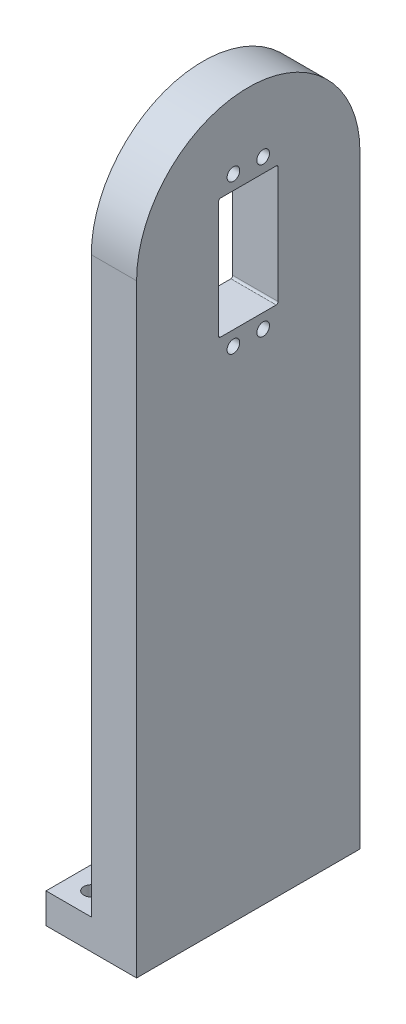
ISO-10303-21;
HEADER;
FILE_DESCRIPTION(('STEP AP214'),'2;1');
FILE_NAME('part.step','',(''),(''),'','','');
FILE_SCHEMA(('AUTOMOTIVE_DESIGN { 1 0 10303 214 1 1 1 1 }'));
ENDSEC;
DATA;
#1=APPLICATION_CONTEXT('core data for automotive mechanical design processes');
#2=APPLICATION_PROTOCOL_DEFINITION('international standard','automotive_design',2000,#1);
#3=PRODUCT_CONTEXT('',#1,'mechanical');
#4=PRODUCT('Part','Part','',(#3));
#5=PRODUCT_RELATED_PRODUCT_CATEGORY('part','',(#4));
#6=PRODUCT_DEFINITION_FORMATION('','',#4);
#7=PRODUCT_DEFINITION_CONTEXT('part definition',#1,'design');
#8=PRODUCT_DEFINITION('design','',#6,#7);
#9=PRODUCT_DEFINITION_SHAPE('','',#8);
#10=(LENGTH_UNIT() NAMED_UNIT(*) SI_UNIT(.MILLI.,.METRE.));
#11=(NAMED_UNIT(*) PLANE_ANGLE_UNIT() SI_UNIT($,.RADIAN.));
#12=(NAMED_UNIT(*) SI_UNIT($,.STERADIAN.) SOLID_ANGLE_UNIT());
#13=UNCERTAINTY_MEASURE_WITH_UNIT(LENGTH_MEASURE(1.E-05),#10,'distance_accuracy_value','');
#14=(GEOMETRIC_REPRESENTATION_CONTEXT(3) GLOBAL_UNCERTAINTY_ASSIGNED_CONTEXT((#13)) GLOBAL_UNIT_ASSIGNED_CONTEXT((#10,
#11,#12)) REPRESENTATION_CONTEXT('',''));
#15=CARTESIAN_POINT('',(0.,0.,0.));
#16=DIRECTION('',(0.,0.,1.));
#17=DIRECTION('',(1.,0.,0.));
#18=AXIS2_PLACEMENT_3D('',#15,#16,#17);
#19=CARTESIAN_POINT('',(15.,0.,0.));
#20=DIRECTION('',(-1.,0.,0.));
#21=DIRECTION('',(0.,0.,1.));
#22=AXIS2_PLACEMENT_3D('',#19,#20,#21);
#23=CYLINDRICAL_SURFACE('',#22,37.);
#24=CARTESIAN_POINT('',(0.,0.,0.));
#25=DIRECTION('',(1.,0.,0.));
#26=DIRECTION('',(0.,0.,-1.));
#27=AXIS2_PLACEMENT_3D('',#24,#25,#26);
#28=CIRCLE('',#27,37.);
#29=CARTESIAN_POINT('',(0.,0.,-37.));
#30=VERTEX_POINT('',#29);
#31=CARTESIAN_POINT('',(0.,0.,37.));
#32=VERTEX_POINT('',#31);
#33=EDGE_CURVE('E211',#30,#32,#28,.T.);
#34=ORIENTED_EDGE('',*,*,#33,.T.);
#35=DIRECTION('',(-1.,0.,0.));
#36=VECTOR('',#35,1.);
#37=CARTESIAN_POINT('',(15.,0.,37.));
#38=LINE('',#37,#36);
#39=CARTESIAN_POINT('',(15.,0.,37.));
#40=VERTEX_POINT('',#39);
#41=EDGE_CURVE('E11',#40,#32,#38,.T.);
#42=ORIENTED_EDGE('',*,*,#41,.F.);
#43=CARTESIAN_POINT('',(15.,0.,0.));
#44=DIRECTION('',(1.,0.,0.));
#45=DIRECTION('',(0.,0.,-1.));
#46=AXIS2_PLACEMENT_3D('',#43,#44,#45);
#47=CIRCLE('',#46,37.);
#48=CARTESIAN_POINT('',(15.,0.,-37.));
#49=VERTEX_POINT('',#48);
#50=EDGE_CURVE('E225',#49,#40,#47,.T.);
#51=ORIENTED_EDGE('',*,*,#50,.F.);
#52=DIRECTION('',(-1.,0.,0.));
#53=VECTOR('',#52,1.);
#54=CARTESIAN_POINT('',(15.,0.,-37.));
#55=LINE('',#54,#53);
#56=EDGE_CURVE('E235',#49,#30,#55,.T.);
#57=ORIENTED_EDGE('',*,*,#56,.T.);
#58=EDGE_LOOP('',(#34,#42,#51,#57));
#59=FACE_BOUND('',#58,.T.);
#60=ADVANCED_FACE('F33',(#59),#23,.T.);
#61=CARTESIAN_POINT('',(15.,0.,37.));
#62=DIRECTION('',(0.,0.,-1.));
#63=DIRECTION('',(0.,1.,0.));
#64=AXIS2_PLACEMENT_3D('',#61,#62,#63);
#65=PLANE('',#64);
#66=DIRECTION('',(0.,-1.,0.));
#67=VECTOR('',#66,1.);
#68=CARTESIAN_POINT('',(0.,0.,37.));
#69=LINE('',#68,#67);
#70=CARTESIAN_POINT('',(0.,-190.,37.));
#71=VERTEX_POINT('',#70);
#72=EDGE_CURVE('E152',#32,#71,#69,.T.);
#73=ORIENTED_EDGE('',*,*,#72,.T.);
#74=DIRECTION('',(-1.,0.,0.));
#75=VECTOR('',#74,1.);
#76=CARTESIAN_POINT('',(0.,-190.,37.));
#77=LINE('',#76,#75);
#78=CARTESIAN_POINT('',(-15.,-190.,37.));
#79=VERTEX_POINT('',#78);
#80=EDGE_CURVE('E47',#71,#79,#77,.T.);
#81=ORIENTED_EDGE('',*,*,#80,.T.);
#82=DIRECTION('',(0.,-1.,0.));
#83=VECTOR('',#82,1.);
#84=CARTESIAN_POINT('',(-15.,-190.,37.));
#85=LINE('',#84,#83);
#86=CARTESIAN_POINT('',(-15.,-200.,37.));
#87=VERTEX_POINT('',#86);
#88=EDGE_CURVE('E135',#79,#87,#85,.T.);
#89=ORIENTED_EDGE('',*,*,#88,.T.);
#90=DIRECTION('',(-1.,0.,0.));
#91=VECTOR('',#90,1.);
#92=CARTESIAN_POINT('',(15.,-200.,37.));
#93=LINE('',#92,#91);
#94=CARTESIAN_POINT('',(15.,-200.,37.));
#95=VERTEX_POINT('',#94);
#96=EDGE_CURVE('E40',#95,#87,#93,.T.);
#97=ORIENTED_EDGE('',*,*,#96,.F.);
#98=DIRECTION('',(0.,-1.,0.));
#99=VECTOR('',#98,1.);
#100=CARTESIAN_POINT('',(15.,0.,37.));
#101=LINE('',#100,#99);
#102=EDGE_CURVE('E228',#40,#95,#101,.T.);
#103=ORIENTED_EDGE('',*,*,#102,.F.);
#104=ORIENTED_EDGE('',*,*,#41,.T.);
#105=EDGE_LOOP('',(#73,#81,#89,#97,#103,#104));
#106=FACE_BOUND('',#105,.T.);
#107=ADVANCED_FACE('F151',(#106),#65,.F.);
#108=CARTESIAN_POINT('',(15.,-200.,37.));
#109=DIRECTION('',(0.,1.,0.));
#110=DIRECTION('',(0.,0.,1.));
#111=AXIS2_PLACEMENT_3D('',#108,#109,#110);
#112=PLANE('',#111);
#113=CARTESIAN_POINT('',(-7.5,-200.,-29.5));
#114=DIRECTION('',(0.,1.,0.));
#115=DIRECTION('',(0.,0.,1.));
#116=AXIS2_PLACEMENT_3D('',#113,#114,#115);
#117=CIRCLE('',#116,2.5);
#118=CARTESIAN_POINT('',(-7.5,-200.,-27.));
#119=VERTEX_POINT('',#118);
#120=EDGE_CURVE('E160',#119,#119,#117,.T.);
#121=ORIENTED_EDGE('',*,*,#120,.T.);
#122=EDGE_LOOP('',(#121));
#123=FACE_BOUND('',#122,.T.);
#124=CARTESIAN_POINT('',(-7.5,-200.,29.5));
#125=DIRECTION('',(0.,1.,0.));
#126=DIRECTION('',(0.,0.,1.));
#127=AXIS2_PLACEMENT_3D('',#124,#125,#126);
#128=CIRCLE('',#127,2.5);
#129=CARTESIAN_POINT('',(-7.5,-200.,32.));
#130=VERTEX_POINT('',#129);
#131=EDGE_CURVE('E521',#130,#130,#128,.T.);
#132=ORIENTED_EDGE('',*,*,#131,.T.);
#133=EDGE_LOOP('',(#132));
#134=FACE_BOUND('',#133,.T.);
#135=ORIENTED_EDGE('',*,*,#96,.T.);
#136=DIRECTION('',(0.,0.,-1.));
#137=VECTOR('',#136,1.);
#138=CARTESIAN_POINT('',(-15.,-200.,37.));
#139=LINE('',#138,#137);
#140=CARTESIAN_POINT('',(-15.,-200.,-37.));
#141=VERTEX_POINT('',#140);
#142=EDGE_CURVE('E141',#87,#141,#139,.T.);
#143=ORIENTED_EDGE('',*,*,#142,.T.);
#144=DIRECTION('',(-1.,0.,0.));
#145=VECTOR('',#144,1.);
#146=CARTESIAN_POINT('',(15.,-200.,-37.));
#147=LINE('',#146,#145);
#148=CARTESIAN_POINT('',(15.,-200.,-37.));
#149=VERTEX_POINT('',#148);
#150=EDGE_CURVE('E242',#149,#141,#147,.T.);
#151=ORIENTED_EDGE('',*,*,#150,.F.);
#152=DIRECTION('',(0.,0.,-1.));
#153=VECTOR('',#152,1.);
#154=CARTESIAN_POINT('',(15.,-200.,37.));
#155=LINE('',#154,#153);
#156=EDGE_CURVE('E231',#95,#149,#155,.T.);
#157=ORIENTED_EDGE('',*,*,#156,.F.);
#158=EDGE_LOOP('',(#135,#143,#151,#157));
#159=FACE_BOUND('',#158,.T.);
#160=ADVANCED_FACE('F245',(#123,#134,#159),#112,.F.);
#161=CARTESIAN_POINT('',(15.,-200.,-37.));
#162=DIRECTION('',(0.,0.,1.));
#163=DIRECTION('',(0.,-1.,0.));
#164=AXIS2_PLACEMENT_3D('',#161,#162,#163);
#165=PLANE('',#164);
#166=ORIENTED_EDGE('',*,*,#150,.T.);
#167=DIRECTION('',(0.,-1.,0.));
#168=VECTOR('',#167,1.);
#169=CARTESIAN_POINT('',(-15.,-190.,-37.));
#170=LINE('',#169,#168);
#171=CARTESIAN_POINT('',(-15.,-190.,-37.));
#172=VERTEX_POINT('',#171);
#173=EDGE_CURVE('E144',#172,#141,#170,.T.);
#174=ORIENTED_EDGE('',*,*,#173,.F.);
#175=DIRECTION('',(1.,0.,0.));
#176=VECTOR('',#175,1.);
#177=CARTESIAN_POINT('',(-15.,-190.,-37.));
#178=LINE('',#177,#176);
#179=CARTESIAN_POINT('',(0.,-190.,-37.));
#180=VERTEX_POINT('',#179);
#181=EDGE_CURVE('E145',#172,#180,#178,.T.);
#182=ORIENTED_EDGE('',*,*,#181,.T.);
#183=DIRECTION('',(0.,1.,0.));
#184=VECTOR('',#183,1.);
#185=CARTESIAN_POINT('',(0.,-200.,-37.));
#186=LINE('',#185,#184);
#187=EDGE_CURVE('E229',#180,#30,#186,.T.);
#188=ORIENTED_EDGE('',*,*,#187,.T.);
#189=ORIENTED_EDGE('',*,*,#56,.F.);
#190=DIRECTION('',(0.,1.,0.));
#191=VECTOR('',#190,1.);
#192=CARTESIAN_POINT('',(15.,-200.,-37.));
#193=LINE('',#192,#191);
#194=EDGE_CURVE('E233',#149,#49,#193,.T.);
#195=ORIENTED_EDGE('',*,*,#194,.F.);
#196=EDGE_LOOP('',(#166,#174,#182,#188,#189,#195));
#197=FACE_BOUND('',#196,.T.);
#198=ADVANCED_FACE('F259',(#197),#165,.F.);
#199=CARTESIAN_POINT('',(15.,0.,0.));
#200=DIRECTION('',(1.,0.,0.));
#201=DIRECTION('',(0.,0.,-1.));
#202=AXIS2_PLACEMENT_3D('',#199,#200,#201);
#203=PLANE('',#202);
#204=CARTESIAN_POINT('',(15.,14.6111456180002,-4.92500000000001));
#205=DIRECTION('',(-1.,0.,0.));
#206=DIRECTION('',(0.,0.,1.));
#207=AXIS2_PLACEMENT_3D('',#204,#205,#206);
#208=CIRCLE('',#207,2.10000000000001);
#209=CARTESIAN_POINT('',(15.,14.6111456180002,-2.82499999999999));
#210=VERTEX_POINT('',#209);
#211=EDGE_CURVE('E494',#210,#210,#208,.T.);
#212=ORIENTED_EDGE('',*,*,#211,.T.);
#213=EDGE_LOOP('',(#212));
#214=FACE_BOUND('',#213,.T.);
#215=CARTESIAN_POINT('',(15.,-34.8111456180001,4.92499999999995));
#216=DIRECTION('',(-1.,0.,0.));
#217=DIRECTION('',(0.,0.,1.));
#218=AXIS2_PLACEMENT_3D('',#215,#216,#217);
#219=CIRCLE('',#218,2.10000000000001);
#220=CARTESIAN_POINT('',(15.,-34.8111456180001,7.02499999999996));
#221=VERTEX_POINT('',#220);
#222=EDGE_CURVE('E498',#221,#221,#219,.T.);
#223=ORIENTED_EDGE('',*,*,#222,.T.);
#224=EDGE_LOOP('',(#223));
#225=FACE_BOUND('',#224,.T.);
#226=CARTESIAN_POINT('',(15.,-34.8111456180001,-4.92500000000005));
#227=DIRECTION('',(-1.,0.,0.));
#228=DIRECTION('',(0.,0.,1.));
#229=AXIS2_PLACEMENT_3D('',#226,#227,#228);
#230=CIRCLE('',#229,2.10000000000001);
#231=CARTESIAN_POINT('',(15.,-34.8111456180001,-2.82500000000004));
#232=VERTEX_POINT('',#231);
#233=EDGE_CURVE('E509',#232,#232,#230,.T.);
#234=ORIENTED_EDGE('',*,*,#233,.T.);
#235=EDGE_LOOP('',(#234));
#236=FACE_BOUND('',#235,.T.);
#237=CARTESIAN_POINT('',(15.,14.6111456180002,4.92499999999999));
#238=DIRECTION('',(-1.,0.,0.));
#239=DIRECTION('',(0.,0.,1.));
#240=AXIS2_PLACEMENT_3D('',#237,#238,#239);
#241=CIRCLE('',#240,2.10000000000001);
#242=CARTESIAN_POINT('',(15.,14.6111456180002,7.025));
#243=VERTEX_POINT('',#242);
#244=EDGE_CURVE('E510',#243,#243,#241,.T.);
#245=ORIENTED_EDGE('',*,*,#244,.T.);
#246=EDGE_LOOP('',(#245));
#247=FACE_BOUND('',#246,.T.);
#248=CARTESIAN_POINT('',(15.,9.23079475642148,9.2307947564221));
#249=DIRECTION('',(1.,0.,0.));
#250=DIRECTION('',(0.,0.,1.));
#251=AXIS2_PLACEMENT_3D('',#248,#249,#250);
#252=CIRCLE('',#251,0.614526901040048);
#253=CARTESIAN_POINT('',(15.,9.84532165746153,9.23079475642208));
#254=VERTEX_POINT('',#253);
#255=CARTESIAN_POINT('',(15.,9.23079475642148,9.84532165746215));
#256=VERTEX_POINT('',#255);
#257=EDGE_CURVE('E55',#254,#256,#252,.T.);
#258=ORIENTED_EDGE('',*,*,#257,.F.);
#259=DIRECTION('',(0.,0.,1.));
#260=VECTOR('',#259,1.);
#261=CARTESIAN_POINT('',(15.,9.84532165746153,9.23079475642208));
#262=LINE('',#261,#260);
#263=CARTESIAN_POINT('',(15.,9.84532165746153,-9.23079475642052));
#264=VERTEX_POINT('',#263);
#265=EDGE_CURVE('E166',#264,#254,#262,.T.);
#266=ORIENTED_EDGE('',*,*,#265,.F.);
#267=CARTESIAN_POINT('',(15.,9.23079475642145,-9.23079475642052));
#268=DIRECTION('',(1.,0.,0.));
#269=DIRECTION('',(0.,0.,1.));
#270=AXIS2_PLACEMENT_3D('',#267,#268,#269);
#271=CIRCLE('',#270,0.614526901040072);
#272=CARTESIAN_POINT('',(15.,9.23079475642148,-9.8453216574606));
#273=VERTEX_POINT('',#272);
#274=EDGE_CURVE('E204',#273,#264,#271,.T.);
#275=ORIENTED_EDGE('',*,*,#274,.F.);
#276=DIRECTION('',(0.,0.999999992647895,0.000121260915794234));
#277=VECTOR('',#276,1.);
#278=CARTESIAN_POINT('',(15.,9.23079475642148,-9.84532165746059));
#279=LINE('',#278,#277);
#280=CARTESIAN_POINT('',(15.,-29.3499999999998,-9.84999999999922));
#281=VERTEX_POINT('',#280);
#282=EDGE_CURVE('E201',#281,#273,#279,.T.);
#283=ORIENTED_EDGE('',*,*,#282,.F.);
#284=CARTESIAN_POINT('',(15.,-29.3500848710849,-9.15009530394592));
#285=DIRECTION('',(1.,0.,0.));
#286=DIRECTION('',(0.,0.,1.));
#287=AXIS2_PLACEMENT_3D('',#284,#285,#286);
#288=CIRCLE('',#287,0.699904701199077);
#289=CARTESIAN_POINT('',(15.,-30.0453216574612,-9.23079475642052));
#290=VERTEX_POINT('',#289);
#291=EDGE_CURVE('E198',#290,#281,#288,.T.);
#292=ORIENTED_EDGE('',*,*,#291,.F.);
#293=DIRECTION('',(0.,0.,-1.));
#294=VECTOR('',#293,1.);
#295=CARTESIAN_POINT('',(15.,-30.0453216574612,-9.23079475642052));
#296=LINE('',#295,#294);
#297=CARTESIAN_POINT('',(15.,-30.0453216574612,9.23079475642209));
#298=VERTEX_POINT('',#297);
#299=EDGE_CURVE('E195',#298,#290,#296,.T.);
#300=ORIENTED_EDGE('',*,*,#299,.F.);
#301=CARTESIAN_POINT('',(15.,-29.4307947564211,9.23079475642209));
#302=DIRECTION('',(1.,0.,0.));
#303=DIRECTION('',(0.,0.,1.));
#304=AXIS2_PLACEMENT_3D('',#301,#302,#303);
#305=CIRCLE('',#304,0.614526901040062);
#306=CARTESIAN_POINT('',(15.,-29.4307947564211,9.84532165746215));
#307=VERTEX_POINT('',#306);
#308=EDGE_CURVE('E192',#307,#298,#305,.T.);
#309=ORIENTED_EDGE('',*,*,#308,.F.);
#310=DIRECTION('',(0.,-1.,0.));
#311=VECTOR('',#310,1.);
#312=CARTESIAN_POINT('',(15.,-29.4307947564211,9.84532165746215));
#313=LINE('',#312,#311);
#314=EDGE_CURVE('E189',#256,#307,#313,.T.);
#315=ORIENTED_EDGE('',*,*,#314,.F.);
#316=EDGE_LOOP('',(#258,#266,#275,#283,#292,#300,#309,#315));
#317=FACE_BOUND('',#316,.T.);
#318=ORIENTED_EDGE('',*,*,#50,.T.);
#319=ORIENTED_EDGE('',*,*,#102,.T.);
#320=ORIENTED_EDGE('',*,*,#156,.T.);
#321=ORIENTED_EDGE('',*,*,#194,.T.);
#322=EDGE_LOOP('',(#318,#319,#320,#321));
#323=FACE_BOUND('',#322,.T.);
#324=ADVANCED_FACE('F250',(#214,#225,#236,#247,#317,#323),#203,.T.);
#325=CARTESIAN_POINT('',(0.,0.,0.));
#326=DIRECTION('',(1.,0.,0.));
#327=DIRECTION('',(0.,0.,-1.));
#328=AXIS2_PLACEMENT_3D('',#325,#326,#327);
#329=PLANE('',#328);
#330=CARTESIAN_POINT('',(0.,14.6111456180002,-4.92500000000001));
#331=DIRECTION('',(-1.,0.,0.));
#332=DIRECTION('',(0.,0.,1.));
#333=AXIS2_PLACEMENT_3D('',#330,#331,#332);
#334=CIRCLE('',#333,2.10000000000001);
#335=CARTESIAN_POINT('',(0.,14.6111456180002,-2.82499999999999));
#336=VERTEX_POINT('',#335);
#337=EDGE_CURVE('E497',#336,#336,#334,.T.);
#338=ORIENTED_EDGE('',*,*,#337,.F.);
#339=EDGE_LOOP('',(#338));
#340=FACE_BOUND('',#339,.T.);
#341=CARTESIAN_POINT('',(0.,-34.8111456180001,4.92499999999995));
#342=DIRECTION('',(-1.,0.,0.));
#343=DIRECTION('',(0.,0.,1.));
#344=AXIS2_PLACEMENT_3D('',#341,#342,#343);
#345=CIRCLE('',#344,2.10000000000001);
#346=CARTESIAN_POINT('',(0.,-34.8111456180001,7.02499999999996));
#347=VERTEX_POINT('',#346);
#348=EDGE_CURVE('E503',#347,#347,#345,.T.);
#349=ORIENTED_EDGE('',*,*,#348,.F.);
#350=EDGE_LOOP('',(#349));
#351=FACE_BOUND('',#350,.T.);
#352=CARTESIAN_POINT('',(0.,-34.8111456180001,-4.92500000000005));
#353=DIRECTION('',(-1.,0.,0.));
#354=DIRECTION('',(0.,0.,1.));
#355=AXIS2_PLACEMENT_3D('',#352,#353,#354);
#356=CIRCLE('',#355,2.10000000000001);
#357=CARTESIAN_POINT('',(0.,-34.8111456180001,-2.82500000000004));
#358=VERTEX_POINT('',#357);
#359=EDGE_CURVE('E540',#358,#358,#356,.T.);
#360=ORIENTED_EDGE('',*,*,#359,.F.);
#361=EDGE_LOOP('',(#360));
#362=FACE_BOUND('',#361,.T.);
#363=CARTESIAN_POINT('',(0.,14.6111456180002,4.92499999999999));
#364=DIRECTION('',(-1.,0.,0.));
#365=DIRECTION('',(0.,0.,1.));
#366=AXIS2_PLACEMENT_3D('',#363,#364,#365);
#367=CIRCLE('',#366,2.10000000000001);
#368=CARTESIAN_POINT('',(0.,14.6111456180002,7.025));
#369=VERTEX_POINT('',#368);
#370=EDGE_CURVE('E500',#369,#369,#367,.T.);
#371=ORIENTED_EDGE('',*,*,#370,.F.);
#372=EDGE_LOOP('',(#371));
#373=FACE_BOUND('',#372,.T.);
#374=DIRECTION('',(0.,0.,1.));
#375=VECTOR('',#374,1.);
#376=CARTESIAN_POINT('',(0.,9.84532165746153,9.23079475642208));
#377=LINE('',#376,#375);
#378=CARTESIAN_POINT('',(0.,9.84532165746153,-9.23079475642052));
#379=VERTEX_POINT('',#378);
#380=CARTESIAN_POINT('',(0.,9.84532165746153,9.23079475642208));
#381=VERTEX_POINT('',#380);
#382=EDGE_CURVE('E184',#379,#381,#377,.T.);
#383=ORIENTED_EDGE('',*,*,#382,.T.);
#384=CARTESIAN_POINT('',(0.,9.23079475642148,9.2307947564221));
#385=DIRECTION('',(1.,0.,0.));
#386=DIRECTION('',(0.,0.,1.));
#387=AXIS2_PLACEMENT_3D('',#384,#385,#386);
#388=CIRCLE('',#387,0.614526901040048);
#389=CARTESIAN_POINT('',(0.,9.23079475642148,9.84532165746215));
#390=VERTEX_POINT('',#389);
#391=EDGE_CURVE('E162',#381,#390,#388,.T.);
#392=ORIENTED_EDGE('',*,*,#391,.T.);
#393=DIRECTION('',(0.,-1.,0.));
#394=VECTOR('',#393,1.);
#395=CARTESIAN_POINT('',(0.,-29.4307947564211,9.84532165746215));
#396=LINE('',#395,#394);
#397=CARTESIAN_POINT('',(0.,-29.4307947564211,9.84532165746215));
#398=VERTEX_POINT('',#397);
#399=EDGE_CURVE('E165',#390,#398,#396,.T.);
#400=ORIENTED_EDGE('',*,*,#399,.T.);
#401=CARTESIAN_POINT('',(0.,-29.4307947564211,9.23079475642209));
#402=DIRECTION('',(1.,0.,0.));
#403=DIRECTION('',(0.,0.,1.));
#404=AXIS2_PLACEMENT_3D('',#401,#402,#403);
#405=CIRCLE('',#404,0.614526901040062);
#406=CARTESIAN_POINT('',(0.,-30.0453216574612,9.23079475642209));
#407=VERTEX_POINT('',#406);
#408=EDGE_CURVE('E169',#398,#407,#405,.T.);
#409=ORIENTED_EDGE('',*,*,#408,.T.);
#410=DIRECTION('',(0.,0.,-1.));
#411=VECTOR('',#410,1.);
#412=CARTESIAN_POINT('',(0.,-30.0453216574612,-9.23079475642052));
#413=LINE('',#412,#411);
#414=CARTESIAN_POINT('',(0.,-30.0453216574612,-9.23079475642052));
#415=VERTEX_POINT('',#414);
#416=EDGE_CURVE('E172',#407,#415,#413,.T.);
#417=ORIENTED_EDGE('',*,*,#416,.T.);
#418=CARTESIAN_POINT('',(0.,-29.3500848710849,-9.15009530394592));
#419=DIRECTION('',(1.,0.,0.));
#420=DIRECTION('',(0.,0.,1.));
#421=AXIS2_PLACEMENT_3D('',#418,#419,#420);
#422=CIRCLE('',#421,0.699904701199077);
#423=CARTESIAN_POINT('',(0.,-29.3499999999998,-9.84999999999922));
#424=VERTEX_POINT('',#423);
#425=EDGE_CURVE('E175',#415,#424,#422,.T.);
#426=ORIENTED_EDGE('',*,*,#425,.T.);
#427=DIRECTION('',(0.,0.999999992647895,0.000121260915794234));
#428=VECTOR('',#427,1.);
#429=CARTESIAN_POINT('',(0.,9.23079475642148,-9.84532165746059));
#430=LINE('',#429,#428);
#431=CARTESIAN_POINT('',(0.,9.23079475642148,-9.8453216574606));
#432=VERTEX_POINT('',#431);
#433=EDGE_CURVE('E178',#424,#432,#430,.T.);
#434=ORIENTED_EDGE('',*,*,#433,.T.);
#435=CARTESIAN_POINT('',(0.,9.23079475642145,-9.23079475642052));
#436=DIRECTION('',(1.,0.,0.));
#437=DIRECTION('',(0.,0.,1.));
#438=AXIS2_PLACEMENT_3D('',#435,#436,#437);
#439=CIRCLE('',#438,0.614526901040072);
#440=EDGE_CURVE('E181',#432,#379,#439,.T.);
#441=ORIENTED_EDGE('',*,*,#440,.T.);
#442=EDGE_LOOP('',(#383,#392,#400,#409,#417,#426,#434,#441));
#443=FACE_BOUND('',#442,.T.);
#444=ORIENTED_EDGE('',*,*,#187,.F.);
#445=DIRECTION('',(0.,0.,1.));
#446=VECTOR('',#445,1.);
#447=CARTESIAN_POINT('',(0.,-190.,-37.));
#448=LINE('',#447,#446);
#449=EDGE_CURVE('E153',#180,#71,#448,.T.);
#450=ORIENTED_EDGE('',*,*,#449,.T.);
#451=ORIENTED_EDGE('',*,*,#72,.F.);
#452=ORIENTED_EDGE('',*,*,#33,.F.);
#453=EDGE_LOOP('',(#444,#450,#451,#452));
#454=FACE_BOUND('',#453,.T.);
#455=ADVANCED_FACE('F257',(#340,#351,#362,#373,#443,#454),#329,.F.);
#456=CARTESIAN_POINT('',(0.,9.23079475642148,9.2307947564221));
#457=DIRECTION('',(1.,0.,0.));
#458=DIRECTION('',(0.,0.,-1.));
#459=AXIS2_PLACEMENT_3D('',#456,#457,#458);
#460=CYLINDRICAL_SURFACE('',#459,0.614526901040048);
#461=ORIENTED_EDGE('',*,*,#257,.T.);
#462=DIRECTION('',(1.,0.,0.));
#463=VECTOR('',#462,1.);
#464=CARTESIAN_POINT('',(0.,9.23079475642148,9.84532165746215));
#465=LINE('',#464,#463);
#466=EDGE_CURVE('E187',#390,#256,#465,.T.);
#467=ORIENTED_EDGE('',*,*,#466,.F.);
#468=ORIENTED_EDGE('',*,*,#391,.F.);
#469=DIRECTION('',(1.,0.,0.));
#470=VECTOR('',#469,1.);
#471=CARTESIAN_POINT('',(0.,9.84532165746153,9.23079475642208));
#472=LINE('',#471,#470);
#473=EDGE_CURVE('E209',#381,#254,#472,.T.);
#474=ORIENTED_EDGE('',*,*,#473,.T.);
#475=EDGE_LOOP('',(#461,#467,#468,#474));
#476=FACE_BOUND('',#475,.T.);
#477=ADVANCED_FACE('F336',(#476),#460,.F.);
#478=CARTESIAN_POINT('',(0.,9.84532165746153,9.23079475642208));
#479=DIRECTION('',(0.,1.,0.));
#480=DIRECTION('',(0.,0.,1.));
#481=AXIS2_PLACEMENT_3D('',#478,#479,#480);
#482=PLANE('',#481);
#483=ORIENTED_EDGE('',*,*,#265,.T.);
#484=ORIENTED_EDGE('',*,*,#473,.F.);
#485=ORIENTED_EDGE('',*,*,#382,.F.);
#486=DIRECTION('',(1.,0.,0.));
#487=VECTOR('',#486,1.);
#488=CARTESIAN_POINT('',(0.,9.84532165746153,-9.23079475642052));
#489=LINE('',#488,#487);
#490=EDGE_CURVE('E212',#379,#264,#489,.T.);
#491=ORIENTED_EDGE('',*,*,#490,.T.);
#492=EDGE_LOOP('',(#483,#484,#485,#491));
#493=FACE_BOUND('',#492,.T.);
#494=ADVANCED_FACE('F384',(#493),#482,.F.);
#495=CARTESIAN_POINT('',(0.,9.23079475642145,-9.23079475642052));
#496=DIRECTION('',(1.,0.,0.));
#497=DIRECTION('',(0.,0.,-1.));
#498=AXIS2_PLACEMENT_3D('',#495,#496,#497);
#499=CYLINDRICAL_SURFACE('',#498,0.614526901040072);
#500=ORIENTED_EDGE('',*,*,#274,.T.);
#501=ORIENTED_EDGE('',*,*,#490,.F.);
#502=ORIENTED_EDGE('',*,*,#440,.F.);
#503=DIRECTION('',(1.,0.,0.));
#504=VECTOR('',#503,1.);
#505=CARTESIAN_POINT('',(0.,9.23079475642148,-9.8453216574606));
#506=LINE('',#505,#504);
#507=EDGE_CURVE('E214',#432,#273,#506,.T.);
#508=ORIENTED_EDGE('',*,*,#507,.T.);
#509=EDGE_LOOP('',(#500,#501,#502,#508));
#510=FACE_BOUND('',#509,.T.);
#511=ADVANCED_FACE('F387',(#510),#499,.F.);
#512=CARTESIAN_POINT('',(0.,9.23079475642148,-9.84532165746059));
#513=DIRECTION('',(0.,0.000121260915794234,-0.999999992647895));
#514=DIRECTION('',(0.,0.999999992647895,0.000121260915794234));
#515=AXIS2_PLACEMENT_3D('',#512,#513,#514);
#516=PLANE('',#515);
#517=ORIENTED_EDGE('',*,*,#282,.T.);
#518=ORIENTED_EDGE('',*,*,#507,.F.);
#519=ORIENTED_EDGE('',*,*,#433,.F.);
#520=DIRECTION('',(1.,0.,0.));
#521=VECTOR('',#520,1.);
#522=CARTESIAN_POINT('',(0.,-29.3499999999998,-9.84999999999922));
#523=LINE('',#522,#521);
#524=EDGE_CURVE('E216',#424,#281,#523,.T.);
#525=ORIENTED_EDGE('',*,*,#524,.T.);
#526=EDGE_LOOP('',(#517,#518,#519,#525));
#527=FACE_BOUND('',#526,.T.);
#528=ADVANCED_FACE('F391',(#527),#516,.F.);
#529=CARTESIAN_POINT('',(0.,-29.3500848710849,-9.15009530394592));
#530=DIRECTION('',(1.,0.,0.));
#531=DIRECTION('',(0.,0.,-1.));
#532=AXIS2_PLACEMENT_3D('',#529,#530,#531);
#533=CYLINDRICAL_SURFACE('',#532,0.699904701199077);
#534=ORIENTED_EDGE('',*,*,#291,.T.);
#535=ORIENTED_EDGE('',*,*,#524,.F.);
#536=ORIENTED_EDGE('',*,*,#425,.F.);
#537=DIRECTION('',(1.,0.,0.));
#538=VECTOR('',#537,1.);
#539=CARTESIAN_POINT('',(0.,-30.0453216574612,-9.23079475642052));
#540=LINE('',#539,#538);
#541=EDGE_CURVE('E218',#415,#290,#540,.T.);
#542=ORIENTED_EDGE('',*,*,#541,.T.);
#543=EDGE_LOOP('',(#534,#535,#536,#542));
#544=FACE_BOUND('',#543,.T.);
#545=ADVANCED_FACE('F395',(#544),#533,.F.);
#546=CARTESIAN_POINT('',(0.,-30.0453216574612,-9.23079475642052));
#547=DIRECTION('',(0.,-1.,0.));
#548=DIRECTION('',(0.,0.,-1.));
#549=AXIS2_PLACEMENT_3D('',#546,#547,#548);
#550=PLANE('',#549);
#551=ORIENTED_EDGE('',*,*,#299,.T.);
#552=ORIENTED_EDGE('',*,*,#541,.F.);
#553=ORIENTED_EDGE('',*,*,#416,.F.);
#554=DIRECTION('',(1.,0.,0.));
#555=VECTOR('',#554,1.);
#556=CARTESIAN_POINT('',(0.,-30.0453216574612,9.23079475642209));
#557=LINE('',#556,#555);
#558=EDGE_CURVE('E220',#407,#298,#557,.T.);
#559=ORIENTED_EDGE('',*,*,#558,.T.);
#560=EDGE_LOOP('',(#551,#552,#553,#559));
#561=FACE_BOUND('',#560,.T.);
#562=ADVANCED_FACE('F399',(#561),#550,.F.);
#563=CARTESIAN_POINT('',(0.,-29.4307947564211,9.23079475642209));
#564=DIRECTION('',(1.,0.,0.));
#565=DIRECTION('',(0.,0.,-1.));
#566=AXIS2_PLACEMENT_3D('',#563,#564,#565);
#567=CYLINDRICAL_SURFACE('',#566,0.614526901040062);
#568=ORIENTED_EDGE('',*,*,#308,.T.);
#569=ORIENTED_EDGE('',*,*,#558,.F.);
#570=ORIENTED_EDGE('',*,*,#408,.F.);
#571=DIRECTION('',(1.,0.,0.));
#572=VECTOR('',#571,1.);
#573=CARTESIAN_POINT('',(0.,-29.4307947564211,9.84532165746215));
#574=LINE('',#573,#572);
#575=EDGE_CURVE('E222',#398,#307,#574,.T.);
#576=ORIENTED_EDGE('',*,*,#575,.T.);
#577=EDGE_LOOP('',(#568,#569,#570,#576));
#578=FACE_BOUND('',#577,.T.);
#579=ADVANCED_FACE('F403',(#578),#567,.F.);
#580=CARTESIAN_POINT('',(0.,-29.4307947564211,9.84532165746215));
#581=DIRECTION('',(0.,0.,1.));
#582=DIRECTION('',(1.,0.,0.));
#583=AXIS2_PLACEMENT_3D('',#580,#581,#582);
#584=PLANE('',#583);
#585=ORIENTED_EDGE('',*,*,#314,.T.);
#586=ORIENTED_EDGE('',*,*,#575,.F.);
#587=ORIENTED_EDGE('',*,*,#399,.F.);
#588=ORIENTED_EDGE('',*,*,#466,.T.);
#589=EDGE_LOOP('',(#585,#586,#587,#588));
#590=FACE_BOUND('',#589,.T.);
#591=ADVANCED_FACE('F383',(#590),#584,.F.);
#592=CARTESIAN_POINT('',(-15.,-190.,37.));
#593=DIRECTION('',(-1.,0.,0.));
#594=DIRECTION('',(0.,0.,1.));
#595=AXIS2_PLACEMENT_3D('',#592,#593,#594);
#596=PLANE('',#595);
#597=ORIENTED_EDGE('',*,*,#142,.F.);
#598=ORIENTED_EDGE('',*,*,#88,.F.);
#599=DIRECTION('',(0.,0.,-1.));
#600=VECTOR('',#599,1.);
#601=CARTESIAN_POINT('',(-15.,-190.,37.));
#602=LINE('',#601,#600);
#603=EDGE_CURVE('E138',#79,#172,#602,.T.);
#604=ORIENTED_EDGE('',*,*,#603,.T.);
#605=ORIENTED_EDGE('',*,*,#173,.T.);
#606=EDGE_LOOP('',(#597,#598,#604,#605));
#607=FACE_BOUND('',#606,.T.);
#608=ADVANCED_FACE('F136',(#607),#596,.T.);
#609=CARTESIAN_POINT('',(0.,-190.,0.));
#610=DIRECTION('',(0.,-1.,0.));
#611=DIRECTION('',(0.,0.,-1.));
#612=AXIS2_PLACEMENT_3D('',#609,#610,#611);
#613=PLANE('',#612);
#614=CARTESIAN_POINT('',(-7.5,-190.,-29.5));
#615=DIRECTION('',(0.,1.,0.));
#616=DIRECTION('',(0.,0.,1.));
#617=AXIS2_PLACEMENT_3D('',#614,#615,#616);
#618=CIRCLE('',#617,2.5);
#619=CARTESIAN_POINT('',(-7.5,-190.,-27.));
#620=VERTEX_POINT('',#619);
#621=EDGE_CURVE('E518',#620,#620,#618,.T.);
#622=ORIENTED_EDGE('',*,*,#621,.F.);
#623=EDGE_LOOP('',(#622));
#624=FACE_BOUND('',#623,.T.);
#625=CARTESIAN_POINT('',(-7.5,-190.,29.5));
#626=DIRECTION('',(0.,1.,0.));
#627=DIRECTION('',(0.,0.,1.));
#628=AXIS2_PLACEMENT_3D('',#625,#626,#627);
#629=CIRCLE('',#628,2.5);
#630=CARTESIAN_POINT('',(-7.5,-190.,32.));
#631=VERTEX_POINT('',#630);
#632=EDGE_CURVE('E513',#631,#631,#629,.T.);
#633=ORIENTED_EDGE('',*,*,#632,.F.);
#634=EDGE_LOOP('',(#633));
#635=FACE_BOUND('',#634,.T.);
#636=ORIENTED_EDGE('',*,*,#449,.F.);
#637=ORIENTED_EDGE('',*,*,#181,.F.);
#638=ORIENTED_EDGE('',*,*,#603,.F.);
#639=ORIENTED_EDGE('',*,*,#80,.F.);
#640=EDGE_LOOP('',(#636,#637,#638,#639));
#641=FACE_BOUND('',#640,.T.);
#642=ADVANCED_FACE('F147',(#624,#635,#641),#613,.F.);
#643=CARTESIAN_POINT('',(-7.5,-200.,29.5));
#644=DIRECTION('',(0.,1.,0.));
#645=DIRECTION('',(0.,0.,1.));
#646=AXIS2_PLACEMENT_3D('',#643,#644,#645);
#647=CYLINDRICAL_SURFACE('',#646,2.5);
#648=ORIENTED_EDGE('',*,*,#131,.F.);
#649=EDGE_LOOP('',(#648));
#650=FACE_BOUND('',#649,.T.);
#651=ORIENTED_EDGE('',*,*,#632,.T.);
#652=EDGE_LOOP('',(#651));
#653=FACE_BOUND('',#652,.T.);
#654=ADVANCED_FACE('F297',(#650,#653),#647,.F.);
#655=CARTESIAN_POINT('',(-7.5,-200.,-29.5));
#656=DIRECTION('',(0.,1.,0.));
#657=DIRECTION('',(0.,0.,1.));
#658=AXIS2_PLACEMENT_3D('',#655,#656,#657);
#659=CYLINDRICAL_SURFACE('',#658,2.5);
#660=ORIENTED_EDGE('',*,*,#120,.F.);
#661=EDGE_LOOP('',(#660));
#662=FACE_BOUND('',#661,.T.);
#663=ORIENTED_EDGE('',*,*,#621,.T.);
#664=EDGE_LOOP('',(#663));
#665=FACE_BOUND('',#664,.T.);
#666=ADVANCED_FACE('F307',(#662,#665),#659,.F.);
#667=CARTESIAN_POINT('',(15.,14.6111456180002,4.92499999999999));
#668=DIRECTION('',(-1.,0.,0.));
#669=DIRECTION('',(0.,0.,1.));
#670=AXIS2_PLACEMENT_3D('',#667,#668,#669);
#671=CYLINDRICAL_SURFACE('',#670,2.10000000000001);
#672=ORIENTED_EDGE('',*,*,#244,.F.);
#673=EDGE_LOOP('',(#672));
#674=FACE_BOUND('',#673,.T.);
#675=ORIENTED_EDGE('',*,*,#370,.T.);
#676=EDGE_LOOP('',(#675));
#677=FACE_BOUND('',#676,.T.);
#678=ADVANCED_FACE('F317',(#674,#677),#671,.F.);
#679=CARTESIAN_POINT('',(15.,-34.8111456180001,-4.92500000000005));
#680=DIRECTION('',(-1.,0.,0.));
#681=DIRECTION('',(0.,0.,1.));
#682=AXIS2_PLACEMENT_3D('',#679,#680,#681);
#683=CYLINDRICAL_SURFACE('',#682,2.10000000000001);
#684=ORIENTED_EDGE('',*,*,#233,.F.);
#685=EDGE_LOOP('',(#684));
#686=FACE_BOUND('',#685,.T.);
#687=ORIENTED_EDGE('',*,*,#359,.T.);
#688=EDGE_LOOP('',(#687));
#689=FACE_BOUND('',#688,.T.);
#690=ADVANCED_FACE('F345',(#686,#689),#683,.F.);
#691=CARTESIAN_POINT('',(15.,-34.8111456180001,4.92499999999995));
#692=DIRECTION('',(-1.,0.,0.));
#693=DIRECTION('',(0.,0.,1.));
#694=AXIS2_PLACEMENT_3D('',#691,#692,#693);
#695=CYLINDRICAL_SURFACE('',#694,2.10000000000001);
#696=ORIENTED_EDGE('',*,*,#222,.F.);
#697=EDGE_LOOP('',(#696));
#698=FACE_BOUND('',#697,.T.);
#699=ORIENTED_EDGE('',*,*,#348,.T.);
#700=EDGE_LOOP('',(#699));
#701=FACE_BOUND('',#700,.T.);
#702=ADVANCED_FACE('F355',(#698,#701),#695,.F.);
#703=CARTESIAN_POINT('',(15.,14.6111456180002,-4.92500000000001));
#704=DIRECTION('',(-1.,0.,0.));
#705=DIRECTION('',(0.,0.,1.));
#706=AXIS2_PLACEMENT_3D('',#703,#704,#705);
#707=CYLINDRICAL_SURFACE('',#706,2.10000000000001);
#708=ORIENTED_EDGE('',*,*,#211,.F.);
#709=EDGE_LOOP('',(#708));
#710=FACE_BOUND('',#709,.T.);
#711=ORIENTED_EDGE('',*,*,#337,.T.);
#712=EDGE_LOOP('',(#711));
#713=FACE_BOUND('',#712,.T.);
#714=ADVANCED_FACE('F365',(#710,#713),#707,.F.);
#715=CLOSED_SHELL('',(#60,#107,#160,#198,#324,#455,#477,#494,#511,#528,#545,#562,#579,#591,#608,
#642,#654,#666,#678,#690,#702,#714));
#716=MANIFOLD_SOLID_BREP('B2',#715);
#717=ADVANCED_BREP_SHAPE_REPRESENTATION('',(#18,#716),#14);
#718=SHAPE_DEFINITION_REPRESENTATION(#9,#717);
ENDSEC;
END-ISO-10303-21;
